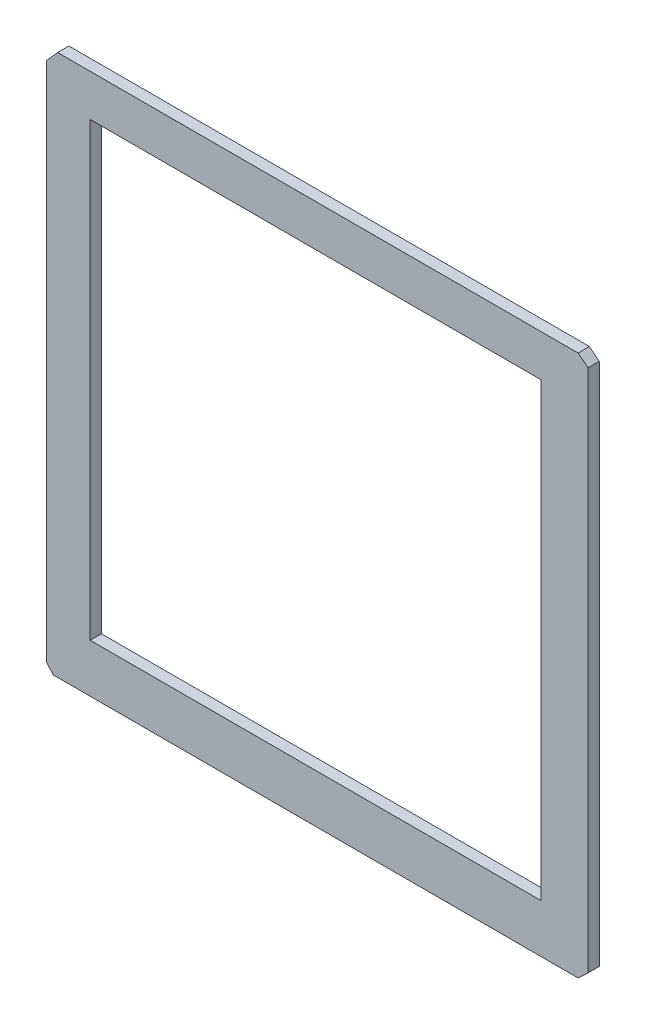
ISO-10303-21;
HEADER;
FILE_DESCRIPTION(('STEP AP214'),'2;1');
FILE_NAME('part.step','',(''),(''),'','','');
FILE_SCHEMA(('AUTOMOTIVE_DESIGN { 1 0 10303 214 1 1 1 1 }'));
ENDSEC;
DATA;
#1=APPLICATION_CONTEXT('core data for automotive mechanical design processes');
#2=APPLICATION_PROTOCOL_DEFINITION('international standard','automotive_design',2000,#1);
#3=PRODUCT_CONTEXT('',#1,'mechanical');
#4=PRODUCT('Part','Part','',(#3));
#5=PRODUCT_RELATED_PRODUCT_CATEGORY('part','',(#4));
#6=PRODUCT_DEFINITION_FORMATION('','',#4);
#7=PRODUCT_DEFINITION_CONTEXT('part definition',#1,'design');
#8=PRODUCT_DEFINITION('design','',#6,#7);
#9=PRODUCT_DEFINITION_SHAPE('','',#8);
#10=(LENGTH_UNIT() NAMED_UNIT(*) SI_UNIT(.MILLI.,.METRE.));
#11=(NAMED_UNIT(*) PLANE_ANGLE_UNIT() SI_UNIT($,.RADIAN.));
#12=(NAMED_UNIT(*) SI_UNIT($,.STERADIAN.) SOLID_ANGLE_UNIT());
#13=UNCERTAINTY_MEASURE_WITH_UNIT(LENGTH_MEASURE(1.E-05),#10,'distance_accuracy_value','');
#14=(GEOMETRIC_REPRESENTATION_CONTEXT(3) GLOBAL_UNCERTAINTY_ASSIGNED_CONTEXT((#13)) GLOBAL_UNIT_ASSIGNED_CONTEXT((#10,
#11,#12)) REPRESENTATION_CONTEXT('',''));
#15=CARTESIAN_POINT('',(0.,0.,0.));
#16=DIRECTION('',(0.,0.,1.));
#17=DIRECTION('',(1.,0.,0.));
#18=AXIS2_PLACEMENT_3D('',#15,#16,#17);
#19=CARTESIAN_POINT('',(0.,0.,1.));
#20=DIRECTION('',(0.,0.,-1.));
#21=DIRECTION('',(-1.,0.,0.));
#22=AXIS2_PLACEMENT_3D('',#19,#20,#21);
#23=PLANE('',#22);
#24=DIRECTION('',(-0.779786833566794,0.626045121533483,0.));
#25=VECTOR('',#24,1.);
#26=CARTESIAN_POINT('',(-9.02100711351492,38.1067721005677,1.));
#27=LINE('',#26,#25);
#28=CARTESIAN_POINT('',(-8.14600931154263,37.4042876757261,1.));
#29=VERTEX_POINT('',#28);
#30=CARTESIAN_POINT('',(-9.02100711351492,38.1067721005677,1.));
#31=VERTEX_POINT('',#30);
#32=EDGE_CURVE('E158',#29,#31,#27,.T.);
#33=ORIENTED_EDGE('',*,*,#32,.T.);
#34=DIRECTION('',(-1.,0.,0.));
#35=VECTOR('',#34,1.);
#36=CARTESIAN_POINT('',(-55.1791447124975,38.1067721005677,1.));
#37=LINE('',#36,#35);
#38=CARTESIAN_POINT('',(-55.1791447124975,38.1067721005677,1.));
#39=VERTEX_POINT('',#38);
#40=EDGE_CURVE('E161',#31,#39,#37,.T.);
#41=ORIENTED_EDGE('',*,*,#40,.T.);
#42=DIRECTION('',(-0.665796870937047,-0.746133048893049,0.));
#43=VECTOR('',#42,1.);
#44=CARTESIAN_POINT('',(-55.1791447124975,38.1067721005677,1.));
#45=LINE('',#44,#43);
#46=CARTESIAN_POINT('',(-56.1460093115426,37.0232439816431,1.));
#47=VERTEX_POINT('',#46);
#48=EDGE_CURVE('E164',#39,#47,#45,.T.);
#49=ORIENTED_EDGE('',*,*,#48,.T.);
#50=DIRECTION('',(0.,-1.,0.));
#51=VECTOR('',#50,1.);
#52=CARTESIAN_POINT('',(-56.1460093115426,-9.22329184617915,1.));
#53=LINE('',#52,#51);
#54=CARTESIAN_POINT('',(-56.1460093115426,-9.22329184617915,1.));
#55=VERTEX_POINT('',#54);
#56=EDGE_CURVE('E166',#47,#55,#53,.T.);
#57=ORIENTED_EDGE('',*,*,#56,.T.);
#58=DIRECTION('',(0.648679986192134,-0.761061282364156,0.));
#59=VECTOR('',#58,1.);
#60=CARTESIAN_POINT('',(-56.1460093115426,-9.22329184617915,1.));
#61=LINE('',#60,#59);
#62=CARTESIAN_POINT('',(-55.5749986454582,-9.89322789943228,1.));
#63=VERTEX_POINT('',#62);
#64=EDGE_CURVE('E168',#55,#63,#61,.T.);
#65=ORIENTED_EDGE('',*,*,#64,.T.);
#66=DIRECTION('',(1.,0.,0.));
#67=VECTOR('',#66,1.);
#68=CARTESIAN_POINT('',(-9.02100711351492,-9.89322789943228,1.));
#69=LINE('',#68,#67);
#70=CARTESIAN_POINT('',(-9.02100711351492,-9.89322789943228,1.));
#71=VERTEX_POINT('',#70);
#72=EDGE_CURVE('E170',#63,#71,#69,.T.);
#73=ORIENTED_EDGE('',*,*,#72,.T.);
#74=DIRECTION('',(0.727510577491527,0.68609646525685,0.));
#75=VECTOR('',#74,1.);
#76=CARTESIAN_POINT('',(-8.14600931154262,-9.06804003603286,1.));
#77=LINE('',#76,#75);
#78=CARTESIAN_POINT('',(-8.14600931154262,-9.06804003603286,1.));
#79=VERTEX_POINT('',#78);
#80=EDGE_CURVE('E172',#71,#79,#77,.T.);
#81=ORIENTED_EDGE('',*,*,#80,.T.);
#82=DIRECTION('',(0.,1.,0.));
#83=VECTOR('',#82,1.);
#84=CARTESIAN_POINT('',(-8.14600931154263,37.4042876757261,1.));
#85=LINE('',#84,#83);
#86=EDGE_CURVE('E174',#79,#29,#85,.T.);
#87=ORIENTED_EDGE('',*,*,#86,.T.);
#88=EDGE_LOOP('',(#33,#41,#49,#57,#65,#73,#81,#87));
#89=FACE_BOUND('',#88,.T.);
#90=DIRECTION('',(0.,-1.,0.));
#91=VECTOR('',#90,1.);
#92=CARTESIAN_POINT('',(-52.2937789790203,-5.5925790754258,1.));
#93=LINE('',#92,#91);
#94=CARTESIAN_POINT('',(-52.2937789790203,34.4074209245742,1.));
#95=VERTEX_POINT('',#94);
#96=CARTESIAN_POINT('',(-52.2937789790203,-5.5925790754258,1.));
#97=VERTEX_POINT('',#96);
#98=EDGE_CURVE('E122',#95,#97,#93,.T.);
#99=ORIENTED_EDGE('',*,*,#98,.F.);
#100=DIRECTION('',(-1.,0.,0.));
#101=VECTOR('',#100,1.);
#102=CARTESIAN_POINT('',(-52.2937789790203,34.4074209245742,1.));
#103=LINE('',#102,#101);
#104=CARTESIAN_POINT('',(-12.2937789790203,34.4074209245742,1.));
#105=VERTEX_POINT('',#104);
#106=EDGE_CURVE('E144',#105,#95,#103,.T.);
#107=ORIENTED_EDGE('',*,*,#106,.F.);
#108=DIRECTION('',(0.,1.,0.));
#109=VECTOR('',#108,1.);
#110=CARTESIAN_POINT('',(-12.2937789790203,34.4074209245742,1.));
#111=LINE('',#110,#109);
#112=CARTESIAN_POINT('',(-12.2937789790203,-5.5925790754258,1.));
#113=VERTEX_POINT('',#112);
#114=EDGE_CURVE('E142',#113,#105,#111,.T.);
#115=ORIENTED_EDGE('',*,*,#114,.F.);
#116=DIRECTION('',(1.,0.,0.));
#117=VECTOR('',#116,1.);
#118=CARTESIAN_POINT('',(-12.2937789790203,-5.5925790754258,1.));
#119=LINE('',#118,#117);
#120=EDGE_CURVE('E130',#97,#113,#119,.T.);
#121=ORIENTED_EDGE('',*,*,#120,.F.);
#122=EDGE_LOOP('',(#99,#107,#115,#121));
#123=FACE_BOUND('',#122,.T.);
#124=ADVANCED_FACE('F33',(#89,#123),#23,.F.);
#125=CARTESIAN_POINT('',(0.,0.,0.));
#126=DIRECTION('',(0.,0.,-1.));
#127=DIRECTION('',(-1.,0.,0.));
#128=AXIS2_PLACEMENT_3D('',#125,#126,#127);
#129=PLANE('',#128);
#130=DIRECTION('',(-0.779786833566794,0.626045121533483,0.));
#131=VECTOR('',#130,1.);
#132=CARTESIAN_POINT('',(-9.02100711351492,38.1067721005677,0.));
#133=LINE('',#132,#131);
#134=CARTESIAN_POINT('',(-8.14600931154263,37.4042876757261,0.));
#135=VERTEX_POINT('',#134);
#136=CARTESIAN_POINT('',(-9.02100711351492,38.1067721005677,0.));
#137=VERTEX_POINT('',#136);
#138=EDGE_CURVE('E138',#135,#137,#133,.T.);
#139=ORIENTED_EDGE('',*,*,#138,.F.);
#140=DIRECTION('',(0.,1.,0.));
#141=VECTOR('',#140,1.);
#142=CARTESIAN_POINT('',(-8.14600931154263,37.4042876757261,0.));
#143=LINE('',#142,#141);
#144=CARTESIAN_POINT('',(-8.14600931154262,-9.06804003603286,0.));
#145=VERTEX_POINT('',#144);
#146=EDGE_CURVE('E162',#145,#135,#143,.T.);
#147=ORIENTED_EDGE('',*,*,#146,.F.);
#148=DIRECTION('',(0.727510577491527,0.68609646525685,0.));
#149=VECTOR('',#148,1.);
#150=CARTESIAN_POINT('',(-8.14600931154262,-9.06804003603286,0.));
#151=LINE('',#150,#149);
#152=CARTESIAN_POINT('',(-9.02100711351492,-9.89322789943228,0.));
#153=VERTEX_POINT('',#152);
#154=EDGE_CURVE('E189',#153,#145,#151,.T.);
#155=ORIENTED_EDGE('',*,*,#154,.F.);
#156=DIRECTION('',(1.,0.,0.));
#157=VECTOR('',#156,1.);
#158=CARTESIAN_POINT('',(-9.02100711351492,-9.89322789943228,0.));
#159=LINE('',#158,#157);
#160=CARTESIAN_POINT('',(-55.5749986454582,-9.89322789943228,0.));
#161=VERTEX_POINT('',#160);
#162=EDGE_CURVE('E187',#161,#153,#159,.T.);
#163=ORIENTED_EDGE('',*,*,#162,.F.);
#164=DIRECTION('',(0.648679986192134,-0.761061282364156,0.));
#165=VECTOR('',#164,1.);
#166=CARTESIAN_POINT('',(-56.1460093115426,-9.22329184617915,0.));
#167=LINE('',#166,#165);
#168=CARTESIAN_POINT('',(-56.1460093115426,-9.22329184617915,0.));
#169=VERTEX_POINT('',#168);
#170=EDGE_CURVE('E185',#169,#161,#167,.T.);
#171=ORIENTED_EDGE('',*,*,#170,.F.);
#172=DIRECTION('',(0.,-1.,0.));
#173=VECTOR('',#172,1.);
#174=CARTESIAN_POINT('',(-56.1460093115426,-9.22329184617915,0.));
#175=LINE('',#174,#173);
#176=CARTESIAN_POINT('',(-56.1460093115426,37.0232439816431,0.));
#177=VERTEX_POINT('',#176);
#178=EDGE_CURVE('E183',#177,#169,#175,.T.);
#179=ORIENTED_EDGE('',*,*,#178,.F.);
#180=DIRECTION('',(-0.665796870937047,-0.746133048893049,0.));
#181=VECTOR('',#180,1.);
#182=CARTESIAN_POINT('',(-55.1791447124975,38.1067721005677,0.));
#183=LINE('',#182,#181);
#184=CARTESIAN_POINT('',(-55.1791447124975,38.1067721005677,0.));
#185=VERTEX_POINT('',#184);
#186=EDGE_CURVE('E181',#185,#177,#183,.T.);
#187=ORIENTED_EDGE('',*,*,#186,.F.);
#188=DIRECTION('',(-1.,0.,0.));
#189=VECTOR('',#188,1.);
#190=CARTESIAN_POINT('',(-55.1791447124975,38.1067721005677,0.));
#191=LINE('',#190,#189);
#192=EDGE_CURVE('E179',#137,#185,#191,.T.);
#193=ORIENTED_EDGE('',*,*,#192,.F.);
#194=EDGE_LOOP('',(#139,#147,#155,#163,#171,#179,#187,#193));
#195=FACE_BOUND('',#194,.T.);
#196=DIRECTION('',(-1.,0.,0.));
#197=VECTOR('',#196,1.);
#198=CARTESIAN_POINT('',(-52.2937789790203,34.4074209245742,0.));
#199=LINE('',#198,#197);
#200=CARTESIAN_POINT('',(-12.2937789790203,34.4074209245742,0.));
#201=VERTEX_POINT('',#200);
#202=CARTESIAN_POINT('',(-52.2937789790203,34.4074209245742,0.));
#203=VERTEX_POINT('',#202);
#204=EDGE_CURVE('E131',#201,#203,#199,.T.);
#205=ORIENTED_EDGE('',*,*,#204,.T.);
#206=DIRECTION('',(0.,-1.,0.));
#207=VECTOR('',#206,1.);
#208=CARTESIAN_POINT('',(-52.2937789790203,-5.5925790754258,0.));
#209=LINE('',#208,#207);
#210=CARTESIAN_POINT('',(-52.2937789790203,-5.5925790754258,0.));
#211=VERTEX_POINT('',#210);
#212=EDGE_CURVE('E56',#203,#211,#209,.T.);
#213=ORIENTED_EDGE('',*,*,#212,.T.);
#214=DIRECTION('',(1.,0.,0.));
#215=VECTOR('',#214,1.);
#216=CARTESIAN_POINT('',(-12.2937789790203,-5.5925790754258,0.));
#217=LINE('',#216,#215);
#218=CARTESIAN_POINT('',(-12.2937789790203,-5.5925790754258,0.));
#219=VERTEX_POINT('',#218);
#220=EDGE_CURVE('E137',#211,#219,#217,.T.);
#221=ORIENTED_EDGE('',*,*,#220,.T.);
#222=DIRECTION('',(0.,1.,0.));
#223=VECTOR('',#222,1.);
#224=CARTESIAN_POINT('',(-12.2937789790203,34.4074209245742,0.));
#225=LINE('',#224,#223);
#226=EDGE_CURVE('E150',#219,#201,#225,.T.);
#227=ORIENTED_EDGE('',*,*,#226,.T.);
#228=EDGE_LOOP('',(#205,#213,#221,#227));
#229=FACE_BOUND('',#228,.T.);
#230=ADVANCED_FACE('F219',(#195,#229),#129,.T.);
#231=CARTESIAN_POINT('',(-9.02100711351492,38.1067721005677,1.));
#232=DIRECTION('',(-0.626045121533483,-0.779786833566794,0.));
#233=DIRECTION('',(0.779786833566794,-0.626045121533483,0.));
#234=AXIS2_PLACEMENT_3D('',#231,#232,#233);
#235=PLANE('',#234);
#236=ORIENTED_EDGE('',*,*,#138,.T.);
#237=DIRECTION('',(0.,0.,-1.));
#238=VECTOR('',#237,1.);
#239=CARTESIAN_POINT('',(-9.02100711351492,38.1067721005677,1.));
#240=LINE('',#239,#238);
#241=EDGE_CURVE('E11',#31,#137,#240,.T.);
#242=ORIENTED_EDGE('',*,*,#241,.F.);
#243=ORIENTED_EDGE('',*,*,#32,.F.);
#244=DIRECTION('',(0.,0.,-1.));
#245=VECTOR('',#244,1.);
#246=CARTESIAN_POINT('',(-8.14600931154263,37.4042876757261,1.));
#247=LINE('',#246,#245);
#248=EDGE_CURVE('E176',#29,#135,#247,.T.);
#249=ORIENTED_EDGE('',*,*,#248,.T.);
#250=EDGE_LOOP('',(#236,#242,#243,#249));
#251=FACE_BOUND('',#250,.T.);
#252=ADVANCED_FACE('F35',(#251),#235,.F.);
#253=CARTESIAN_POINT('',(-55.1791447124975,38.1067721005677,1.));
#254=DIRECTION('',(0.,-1.,0.));
#255=DIRECTION('',(0.,0.,-1.));
#256=AXIS2_PLACEMENT_3D('',#253,#254,#255);
#257=PLANE('',#256);
#258=ORIENTED_EDGE('',*,*,#192,.T.);
#259=DIRECTION('',(0.,0.,-1.));
#260=VECTOR('',#259,1.);
#261=CARTESIAN_POINT('',(-55.1791447124975,38.1067721005677,1.));
#262=LINE('',#261,#260);
#263=EDGE_CURVE('E41',#39,#185,#262,.T.);
#264=ORIENTED_EDGE('',*,*,#263,.F.);
#265=ORIENTED_EDGE('',*,*,#40,.F.);
#266=ORIENTED_EDGE('',*,*,#241,.T.);
#267=EDGE_LOOP('',(#258,#264,#265,#266));
#268=FACE_BOUND('',#267,.T.);
#269=ADVANCED_FACE('F236',(#268),#257,.F.);
#270=CARTESIAN_POINT('',(-55.1791447124975,38.1067721005677,1.));
#271=DIRECTION('',(0.746133048893049,-0.665796870937047,0.));
#272=DIRECTION('',(0.665796870937047,0.746133048893049,0.));
#273=AXIS2_PLACEMENT_3D('',#270,#271,#272);
#274=PLANE('',#273);
#275=ORIENTED_EDGE('',*,*,#186,.T.);
#276=DIRECTION('',(0.,0.,-1.));
#277=VECTOR('',#276,1.);
#278=CARTESIAN_POINT('',(-56.1460093115426,37.0232439816431,1.));
#279=LINE('',#278,#277);
#280=EDGE_CURVE('E206',#47,#177,#279,.T.);
#281=ORIENTED_EDGE('',*,*,#280,.F.);
#282=ORIENTED_EDGE('',*,*,#48,.F.);
#283=ORIENTED_EDGE('',*,*,#263,.T.);
#284=EDGE_LOOP('',(#275,#281,#282,#283));
#285=FACE_BOUND('',#284,.T.);
#286=ADVANCED_FACE('F213',(#285),#274,.F.);
#287=CARTESIAN_POINT('',(-56.1460093115426,-9.22329184617915,1.));
#288=DIRECTION('',(1.,0.,0.));
#289=DIRECTION('',(0.,0.,-1.));
#290=AXIS2_PLACEMENT_3D('',#287,#288,#289);
#291=PLANE('',#290);
#292=ORIENTED_EDGE('',*,*,#178,.T.);
#293=DIRECTION('',(0.,0.,-1.));
#294=VECTOR('',#293,1.);
#295=CARTESIAN_POINT('',(-56.1460093115426,-9.22329184617915,1.));
#296=LINE('',#295,#294);
#297=EDGE_CURVE('E203',#55,#169,#296,.T.);
#298=ORIENTED_EDGE('',*,*,#297,.F.);
#299=ORIENTED_EDGE('',*,*,#56,.F.);
#300=ORIENTED_EDGE('',*,*,#280,.T.);
#301=EDGE_LOOP('',(#292,#298,#299,#300));
#302=FACE_BOUND('',#301,.T.);
#303=ADVANCED_FACE('F225',(#302),#291,.F.);
#304=CARTESIAN_POINT('',(-56.1460093115426,-9.22329184617915,1.));
#305=DIRECTION('',(0.761061282364156,0.648679986192134,0.));
#306=DIRECTION('',(-0.648679986192134,0.761061282364156,0.));
#307=AXIS2_PLACEMENT_3D('',#304,#305,#306);
#308=PLANE('',#307);
#309=ORIENTED_EDGE('',*,*,#170,.T.);
#310=DIRECTION('',(0.,0.,-1.));
#311=VECTOR('',#310,1.);
#312=CARTESIAN_POINT('',(-55.5749986454582,-9.89322789943228,1.));
#313=LINE('',#312,#311);
#314=EDGE_CURVE('E200',#63,#161,#313,.T.);
#315=ORIENTED_EDGE('',*,*,#314,.F.);
#316=ORIENTED_EDGE('',*,*,#64,.F.);
#317=ORIENTED_EDGE('',*,*,#297,.T.);
#318=EDGE_LOOP('',(#309,#315,#316,#317));
#319=FACE_BOUND('',#318,.T.);
#320=ADVANCED_FACE('F229',(#319),#308,.F.);
#321=CARTESIAN_POINT('',(-9.02100711351492,-9.89322789943228,1.));
#322=DIRECTION('',(0.,1.,0.));
#323=DIRECTION('',(-1.,0.,0.));
#324=AXIS2_PLACEMENT_3D('',#321,#322,#323);
#325=PLANE('',#324);
#326=ORIENTED_EDGE('',*,*,#162,.T.);
#327=DIRECTION('',(0.,0.,-1.));
#328=VECTOR('',#327,1.);
#329=CARTESIAN_POINT('',(-9.02100711351492,-9.89322789943228,1.));
#330=LINE('',#329,#328);
#331=EDGE_CURVE('E197',#71,#153,#330,.T.);
#332=ORIENTED_EDGE('',*,*,#331,.F.);
#333=ORIENTED_EDGE('',*,*,#72,.F.);
#334=ORIENTED_EDGE('',*,*,#314,.T.);
#335=EDGE_LOOP('',(#326,#332,#333,#334));
#336=FACE_BOUND('',#335,.T.);
#337=ADVANCED_FACE('F249',(#336),#325,.F.);
#338=CARTESIAN_POINT('',(-8.14600931154262,-9.06804003603286,1.));
#339=DIRECTION('',(-0.68609646525685,0.727510577491527,0.));
#340=DIRECTION('',(-0.727510577491527,-0.68609646525685,0.));
#341=AXIS2_PLACEMENT_3D('',#338,#339,#340);
#342=PLANE('',#341);
#343=ORIENTED_EDGE('',*,*,#154,.T.);
#344=DIRECTION('',(0.,0.,-1.));
#345=VECTOR('',#344,1.);
#346=CARTESIAN_POINT('',(-8.14600931154262,-9.06804003603286,1.));
#347=LINE('',#346,#345);
#348=EDGE_CURVE('E194',#79,#145,#347,.T.);
#349=ORIENTED_EDGE('',*,*,#348,.F.);
#350=ORIENTED_EDGE('',*,*,#80,.F.);
#351=ORIENTED_EDGE('',*,*,#331,.T.);
#352=EDGE_LOOP('',(#343,#349,#350,#351));
#353=FACE_BOUND('',#352,.T.);
#354=ADVANCED_FACE('F247',(#353),#342,.F.);
#355=CARTESIAN_POINT('',(-8.14600931154263,37.4042876757261,1.));
#356=DIRECTION('',(-1.,0.,0.));
#357=DIRECTION('',(0.,-1.,0.));
#358=AXIS2_PLACEMENT_3D('',#355,#356,#357);
#359=PLANE('',#358);
#360=ORIENTED_EDGE('',*,*,#146,.T.);
#361=ORIENTED_EDGE('',*,*,#248,.F.);
#362=ORIENTED_EDGE('',*,*,#86,.F.);
#363=ORIENTED_EDGE('',*,*,#348,.T.);
#364=EDGE_LOOP('',(#360,#361,#362,#363));
#365=FACE_BOUND('',#364,.T.);
#366=ADVANCED_FACE('F242',(#365),#359,.F.);
#367=CARTESIAN_POINT('',(-52.2937789790203,-5.5925790754258,1.));
#368=DIRECTION('',(1.,0.,0.));
#369=DIRECTION('',(0.,0.,-1.));
#370=AXIS2_PLACEMENT_3D('',#367,#368,#369);
#371=PLANE('',#370);
#372=ORIENTED_EDGE('',*,*,#212,.F.);
#373=DIRECTION('',(0.,0.,-1.));
#374=VECTOR('',#373,1.);
#375=CARTESIAN_POINT('',(-52.2937789790203,34.4074209245742,1.));
#376=LINE('',#375,#374);
#377=EDGE_CURVE('E126',#95,#203,#376,.T.);
#378=ORIENTED_EDGE('',*,*,#377,.F.);
#379=ORIENTED_EDGE('',*,*,#98,.T.);
#380=DIRECTION('',(0.,0.,-1.));
#381=VECTOR('',#380,1.);
#382=CARTESIAN_POINT('',(-52.2937789790203,-5.5925790754258,1.));
#383=LINE('',#382,#381);
#384=EDGE_CURVE('E125',#97,#211,#383,.T.);
#385=ORIENTED_EDGE('',*,*,#384,.T.);
#386=EDGE_LOOP('',(#372,#378,#379,#385));
#387=FACE_BOUND('',#386,.T.);
#388=ADVANCED_FACE('F124',(#387),#371,.T.);
#389=CARTESIAN_POINT('',(-12.2937789790203,-5.5925790754258,1.));
#390=DIRECTION('',(0.,1.,0.));
#391=DIRECTION('',(-1.,0.,0.));
#392=AXIS2_PLACEMENT_3D('',#389,#390,#391);
#393=PLANE('',#392);
#394=ORIENTED_EDGE('',*,*,#220,.F.);
#395=ORIENTED_EDGE('',*,*,#384,.F.);
#396=ORIENTED_EDGE('',*,*,#120,.T.);
#397=DIRECTION('',(0.,0.,-1.));
#398=VECTOR('',#397,1.);
#399=CARTESIAN_POINT('',(-12.2937789790203,-5.5925790754258,1.));
#400=LINE('',#399,#398);
#401=EDGE_CURVE('E139',#113,#219,#400,.T.);
#402=ORIENTED_EDGE('',*,*,#401,.T.);
#403=EDGE_LOOP('',(#394,#395,#396,#402));
#404=FACE_BOUND('',#403,.T.);
#405=ADVANCED_FACE('F134',(#404),#393,.T.);
#406=CARTESIAN_POINT('',(-12.2937789790203,34.4074209245742,1.));
#407=DIRECTION('',(-1.,0.,0.));
#408=DIRECTION('',(0.,-1.,0.));
#409=AXIS2_PLACEMENT_3D('',#406,#407,#408);
#410=PLANE('',#409);
#411=ORIENTED_EDGE('',*,*,#226,.F.);
#412=ORIENTED_EDGE('',*,*,#401,.F.);
#413=ORIENTED_EDGE('',*,*,#114,.T.);
#414=DIRECTION('',(0.,0.,-1.));
#415=VECTOR('',#414,1.);
#416=CARTESIAN_POINT('',(-12.2937789790203,34.4074209245742,1.));
#417=LINE('',#416,#415);
#418=EDGE_CURVE('E48',#105,#201,#417,.T.);
#419=ORIENTED_EDGE('',*,*,#418,.T.);
#420=EDGE_LOOP('',(#411,#412,#413,#419));
#421=FACE_BOUND('',#420,.T.);
#422=ADVANCED_FACE('F274',(#421),#410,.T.);
#423=CARTESIAN_POINT('',(-52.2937789790203,34.4074209245742,1.));
#424=DIRECTION('',(0.,-1.,0.));
#425=DIRECTION('',(0.,0.,-1.));
#426=AXIS2_PLACEMENT_3D('',#423,#424,#425);
#427=PLANE('',#426);
#428=ORIENTED_EDGE('',*,*,#204,.F.);
#429=ORIENTED_EDGE('',*,*,#418,.F.);
#430=ORIENTED_EDGE('',*,*,#106,.T.);
#431=ORIENTED_EDGE('',*,*,#377,.T.);
#432=EDGE_LOOP('',(#428,#429,#430,#431));
#433=FACE_BOUND('',#432,.T.);
#434=ADVANCED_FACE('F278',(#433),#427,.T.);
#435=CLOSED_SHELL('',(#124,#230,#252,#269,#286,#303,#320,#337,#354,#366,#388,#405,#422,#434));
#436=MANIFOLD_SOLID_BREP('B2',#435);
#437=ADVANCED_BREP_SHAPE_REPRESENTATION('',(#18,#436),#14);
#438=SHAPE_DEFINITION_REPRESENTATION(#9,#437);
ENDSEC;
END-ISO-10303-21;
